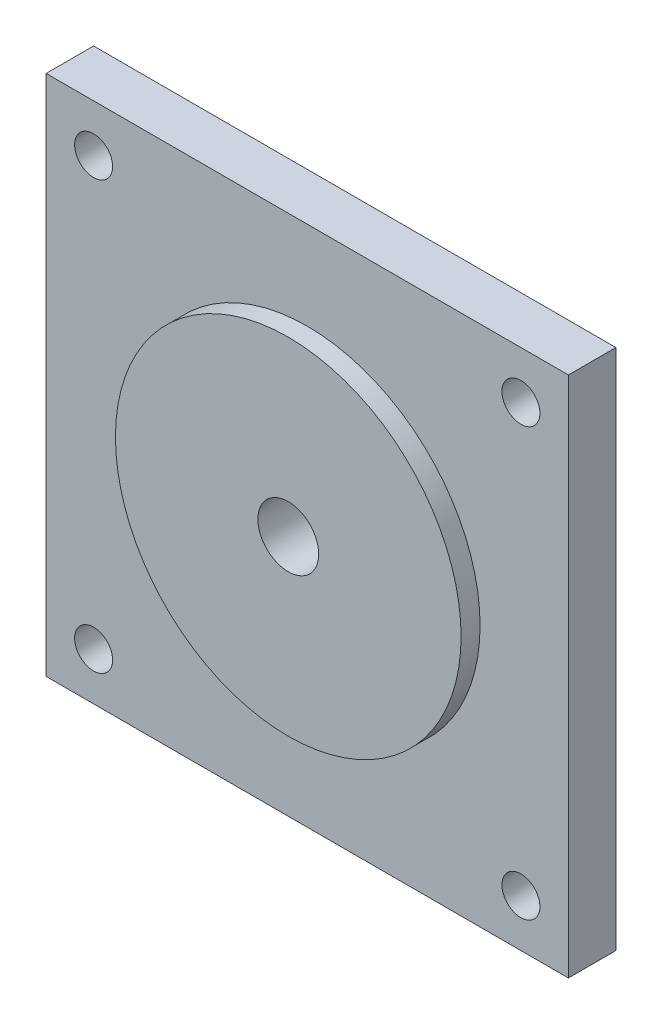
ISO-10303-21;
HEADER;
FILE_DESCRIPTION(('STEP AP214'),'2;1');
FILE_NAME('part.step','',(''),(''),'','','');
FILE_SCHEMA(('AUTOMOTIVE_DESIGN { 1 0 10303 214 1 1 1 1 }'));
ENDSEC;
DATA;
#1=APPLICATION_CONTEXT('core data for automotive mechanical design processes');
#2=APPLICATION_PROTOCOL_DEFINITION('international standard','automotive_design',2000,#1);
#3=PRODUCT_CONTEXT('',#1,'mechanical');
#4=PRODUCT('Part','Part','',(#3));
#5=PRODUCT_RELATED_PRODUCT_CATEGORY('part','',(#4));
#6=PRODUCT_DEFINITION_FORMATION('','',#4);
#7=PRODUCT_DEFINITION_CONTEXT('part definition',#1,'design');
#8=PRODUCT_DEFINITION('design','',#6,#7);
#9=PRODUCT_DEFINITION_SHAPE('','',#8);
#10=(LENGTH_UNIT() NAMED_UNIT(*) SI_UNIT(.MILLI.,.METRE.));
#11=(NAMED_UNIT(*) PLANE_ANGLE_UNIT() SI_UNIT($,.RADIAN.));
#12=(NAMED_UNIT(*) SI_UNIT($,.STERADIAN.) SOLID_ANGLE_UNIT());
#13=UNCERTAINTY_MEASURE_WITH_UNIT(LENGTH_MEASURE(1.E-05),#10,'distance_accuracy_value','');
#14=(GEOMETRIC_REPRESENTATION_CONTEXT(3) GLOBAL_UNCERTAINTY_ASSIGNED_CONTEXT((#13)) GLOBAL_UNIT_ASSIGNED_CONTEXT((#10,
#11,#12)) REPRESENTATION_CONTEXT('',''));
#15=CARTESIAN_POINT('',(0.,0.,0.));
#16=DIRECTION('',(0.,0.,1.));
#17=DIRECTION('',(1.,0.,0.));
#18=AXIS2_PLACEMENT_3D('',#15,#16,#17);
#19=CARTESIAN_POINT('',(0.,0.,5.));
#20=DIRECTION('',(0.,0.,1.));
#21=DIRECTION('',(1.,0.,0.));
#22=AXIS2_PLACEMENT_3D('',#19,#20,#21);
#23=PLANE('',#22);
#24=CARTESIAN_POINT('',(22.5,-22.5,5.));
#25=DIRECTION('',(0.,0.,1.));
#26=DIRECTION('',(1.,0.,0.));
#27=AXIS2_PLACEMENT_3D('',#24,#25,#26);
#28=CIRCLE('',#27,2.00000000000001);
#29=CARTESIAN_POINT('',(24.5,-22.5,5.));
#30=VERTEX_POINT('',#29);
#31=EDGE_CURVE('E129',#30,#30,#28,.T.);
#32=ORIENTED_EDGE('',*,*,#31,.F.);
#33=EDGE_LOOP('',(#32));
#34=FACE_BOUND('',#33,.T.);
#35=CARTESIAN_POINT('',(22.5,22.5,5.));
#36=DIRECTION('',(0.,0.,1.));
#37=DIRECTION('',(1.,0.,0.));
#38=AXIS2_PLACEMENT_3D('',#35,#36,#37);
#39=CIRCLE('',#38,2.00000000000001);
#40=CARTESIAN_POINT('',(24.5,22.5,5.));
#41=VERTEX_POINT('',#40);
#42=EDGE_CURVE('E117',#41,#41,#39,.T.);
#43=ORIENTED_EDGE('',*,*,#42,.F.);
#44=EDGE_LOOP('',(#43));
#45=FACE_BOUND('',#44,.T.);
#46=DIRECTION('',(0.,-1.,0.));
#47=VECTOR('',#46,1.);
#48=CARTESIAN_POINT('',(-27.5,27.5,5.));
#49=LINE('',#48,#47);
#50=CARTESIAN_POINT('',(-27.5,27.5,5.));
#51=VERTEX_POINT('',#50);
#52=CARTESIAN_POINT('',(-27.5,-27.5,5.));
#53=VERTEX_POINT('',#52);
#54=EDGE_CURVE('E84',#51,#53,#49,.T.);
#55=ORIENTED_EDGE('',*,*,#54,.T.);
#56=DIRECTION('',(1.,0.,0.));
#57=VECTOR('',#56,1.);
#58=CARTESIAN_POINT('',(-27.5,-27.5,5.));
#59=LINE('',#58,#57);
#60=CARTESIAN_POINT('',(27.5,-27.5,5.));
#61=VERTEX_POINT('',#60);
#62=EDGE_CURVE('E79',#53,#61,#59,.T.);
#63=ORIENTED_EDGE('',*,*,#62,.T.);
#64=DIRECTION('',(0.,1.,0.));
#65=VECTOR('',#64,1.);
#66=CARTESIAN_POINT('',(27.5,27.5,5.));
#67=LINE('',#66,#65);
#68=CARTESIAN_POINT('',(27.5,27.5,5.));
#69=VERTEX_POINT('',#68);
#70=EDGE_CURVE('E82',#61,#69,#67,.T.);
#71=ORIENTED_EDGE('',*,*,#70,.T.);
#72=DIRECTION('',(-1.,0.,0.));
#73=VECTOR('',#72,1.);
#74=CARTESIAN_POINT('',(-27.5,27.5,5.));
#75=LINE('',#74,#73);
#76=EDGE_CURVE('E49',#69,#51,#75,.T.);
#77=ORIENTED_EDGE('',*,*,#76,.T.);
#78=EDGE_LOOP('',(#55,#63,#71,#77));
#79=FACE_BOUND('',#78,.T.);
#80=CARTESIAN_POINT('',(-22.5,22.5,5.));
#81=DIRECTION('',(0.,0.,1.));
#82=DIRECTION('',(1.,0.,0.));
#83=AXIS2_PLACEMENT_3D('',#80,#81,#82);
#84=CIRCLE('',#83,2.00000000000001);
#85=CARTESIAN_POINT('',(-20.5,22.5,5.));
#86=VERTEX_POINT('',#85);
#87=EDGE_CURVE('E113',#86,#86,#84,.T.);
#88=ORIENTED_EDGE('',*,*,#87,.F.);
#89=EDGE_LOOP('',(#88));
#90=FACE_BOUND('',#89,.T.);
#91=CARTESIAN_POINT('',(-22.5,-22.5,5.));
#92=DIRECTION('',(0.,0.,1.));
#93=DIRECTION('',(1.,0.,0.));
#94=AXIS2_PLACEMENT_3D('',#91,#92,#93);
#95=CIRCLE('',#94,2.);
#96=CARTESIAN_POINT('',(-20.5,-22.5,5.));
#97=VERTEX_POINT('',#96);
#98=EDGE_CURVE('E123',#97,#97,#95,.T.);
#99=ORIENTED_EDGE('',*,*,#98,.F.);
#100=EDGE_LOOP('',(#99));
#101=FACE_BOUND('',#100,.T.);
#102=CARTESIAN_POINT('',(0.,0.,5.));
#103=DIRECTION('',(0.,0.,1.));
#104=DIRECTION('',(1.,0.,0.));
#105=AXIS2_PLACEMENT_3D('',#102,#103,#104);
#106=CIRCLE('',#105,18.2);
#107=CARTESIAN_POINT('',(18.2,0.,5.));
#108=VERTEX_POINT('',#107);
#109=EDGE_CURVE('E138',#108,#108,#106,.T.);
#110=ORIENTED_EDGE('',*,*,#109,.F.);
#111=EDGE_LOOP('',(#110));
#112=FACE_BOUND('',#111,.T.);
#113=ADVANCED_FACE('F32',(#34,#45,#79,#90,#101,#112),#23,.T.);
#114=CARTESIAN_POINT('',(0.,0.,0.));
#115=DIRECTION('',(0.,0.,1.));
#116=DIRECTION('',(1.,0.,0.));
#117=AXIS2_PLACEMENT_3D('',#114,#115,#116);
#118=PLANE('',#117);
#119=DIRECTION('',(0.,-1.,0.));
#120=VECTOR('',#119,1.);
#121=CARTESIAN_POINT('',(-27.5,27.5,0.));
#122=LINE('',#121,#120);
#123=CARTESIAN_POINT('',(-27.5,27.5,0.));
#124=VERTEX_POINT('',#123);
#125=CARTESIAN_POINT('',(-27.5,-27.5,0.));
#126=VERTEX_POINT('',#125);
#127=EDGE_CURVE('E96',#124,#126,#122,.T.);
#128=ORIENTED_EDGE('',*,*,#127,.F.);
#129=DIRECTION('',(-1.,0.,0.));
#130=VECTOR('',#129,1.);
#131=CARTESIAN_POINT('',(-27.5,27.5,0.));
#132=LINE('',#131,#130);
#133=CARTESIAN_POINT('',(27.5,27.5,0.));
#134=VERTEX_POINT('',#133);
#135=EDGE_CURVE('E72',#134,#124,#132,.T.);
#136=ORIENTED_EDGE('',*,*,#135,.F.);
#137=DIRECTION('',(0.,1.,0.));
#138=VECTOR('',#137,1.);
#139=CARTESIAN_POINT('',(27.5,27.5,0.));
#140=LINE('',#139,#138);
#141=CARTESIAN_POINT('',(27.5,-27.5,0.));
#142=VERTEX_POINT('',#141);
#143=EDGE_CURVE('E66',#142,#134,#140,.T.);
#144=ORIENTED_EDGE('',*,*,#143,.F.);
#145=DIRECTION('',(1.,0.,0.));
#146=VECTOR('',#145,1.);
#147=CARTESIAN_POINT('',(-27.5,-27.5,0.));
#148=LINE('',#147,#146);
#149=EDGE_CURVE('E88',#126,#142,#148,.T.);
#150=ORIENTED_EDGE('',*,*,#149,.F.);
#151=EDGE_LOOP('',(#128,#136,#144,#150));
#152=FACE_BOUND('',#151,.T.);
#153=CARTESIAN_POINT('',(0.,0.,0.));
#154=DIRECTION('',(0.,0.,1.));
#155=DIRECTION('',(1.,0.,0.));
#156=AXIS2_PLACEMENT_3D('',#153,#154,#155);
#157=CIRCLE('',#156,3.2);
#158=CARTESIAN_POINT('',(3.2,0.,0.));
#159=VERTEX_POINT('',#158);
#160=EDGE_CURVE('E99',#159,#159,#157,.T.);
#161=ORIENTED_EDGE('',*,*,#160,.T.);
#162=EDGE_LOOP('',(#161));
#163=FACE_BOUND('',#162,.T.);
#164=CARTESIAN_POINT('',(-22.5,22.5,0.));
#165=DIRECTION('',(0.,0.,1.));
#166=DIRECTION('',(1.,0.,0.));
#167=AXIS2_PLACEMENT_3D('',#164,#165,#166);
#168=CIRCLE('',#167,2.00000000000001);
#169=CARTESIAN_POINT('',(-20.5,22.5,0.));
#170=VERTEX_POINT('',#169);
#171=EDGE_CURVE('E114',#170,#170,#168,.T.);
#172=ORIENTED_EDGE('',*,*,#171,.T.);
#173=EDGE_LOOP('',(#172));
#174=FACE_BOUND('',#173,.T.);
#175=CARTESIAN_POINT('',(22.5,22.5,0.));
#176=DIRECTION('',(0.,0.,1.));
#177=DIRECTION('',(1.,0.,0.));
#178=AXIS2_PLACEMENT_3D('',#175,#176,#177);
#179=CIRCLE('',#178,2.00000000000001);
#180=CARTESIAN_POINT('',(24.5,22.5,0.));
#181=VERTEX_POINT('',#180);
#182=EDGE_CURVE('E120',#181,#181,#179,.T.);
#183=ORIENTED_EDGE('',*,*,#182,.T.);
#184=EDGE_LOOP('',(#183));
#185=FACE_BOUND('',#184,.T.);
#186=CARTESIAN_POINT('',(-22.5,-22.5,0.));
#187=DIRECTION('',(0.,0.,1.));
#188=DIRECTION('',(1.,0.,0.));
#189=AXIS2_PLACEMENT_3D('',#186,#187,#188);
#190=CIRCLE('',#189,2.);
#191=CARTESIAN_POINT('',(-20.5,-22.5,0.));
#192=VERTEX_POINT('',#191);
#193=EDGE_CURVE('E126',#192,#192,#190,.T.);
#194=ORIENTED_EDGE('',*,*,#193,.T.);
#195=EDGE_LOOP('',(#194));
#196=FACE_BOUND('',#195,.T.);
#197=CARTESIAN_POINT('',(22.5,-22.5,0.));
#198=DIRECTION('',(0.,0.,1.));
#199=DIRECTION('',(1.,0.,0.));
#200=AXIS2_PLACEMENT_3D('',#197,#198,#199);
#201=CIRCLE('',#200,2.00000000000001);
#202=CARTESIAN_POINT('',(24.5,-22.5,0.));
#203=VERTEX_POINT('',#202);
#204=EDGE_CURVE('E132',#203,#203,#201,.T.);
#205=ORIENTED_EDGE('',*,*,#204,.T.);
#206=EDGE_LOOP('',(#205));
#207=FACE_BOUND('',#206,.T.);
#208=ADVANCED_FACE('F107',(#152,#163,#174,#185,#196,#207),#118,.F.);
#209=CARTESIAN_POINT('',(-27.5,27.5,5.));
#210=DIRECTION('',(1.,0.,0.));
#211=DIRECTION('',(0.,1.,0.));
#212=AXIS2_PLACEMENT_3D('',#209,#210,#211);
#213=PLANE('',#212);
#214=ORIENTED_EDGE('',*,*,#127,.T.);
#215=DIRECTION('',(0.,0.,-1.));
#216=VECTOR('',#215,1.);
#217=CARTESIAN_POINT('',(-27.5,-27.5,5.));
#218=LINE('',#217,#216);
#219=EDGE_CURVE('E11',#53,#126,#218,.T.);
#220=ORIENTED_EDGE('',*,*,#219,.F.);
#221=ORIENTED_EDGE('',*,*,#54,.F.);
#222=DIRECTION('',(0.,0.,-1.));
#223=VECTOR('',#222,1.);
#224=CARTESIAN_POINT('',(-27.5,27.5,5.));
#225=LINE('',#224,#223);
#226=EDGE_CURVE('E92',#51,#124,#225,.T.);
#227=ORIENTED_EDGE('',*,*,#226,.T.);
#228=EDGE_LOOP('',(#214,#220,#221,#227));
#229=FACE_BOUND('',#228,.T.);
#230=ADVANCED_FACE('F34',(#229),#213,.F.);
#231=CARTESIAN_POINT('',(-27.5,-27.5,5.));
#232=DIRECTION('',(0.,1.,0.));
#233=DIRECTION('',(0.,0.,1.));
#234=AXIS2_PLACEMENT_3D('',#231,#232,#233);
#235=PLANE('',#234);
#236=ORIENTED_EDGE('',*,*,#149,.T.);
#237=DIRECTION('',(0.,0.,-1.));
#238=VECTOR('',#237,1.);
#239=CARTESIAN_POINT('',(27.5,-27.5,5.));
#240=LINE('',#239,#238);
#241=EDGE_CURVE('E41',#61,#142,#240,.T.);
#242=ORIENTED_EDGE('',*,*,#241,.F.);
#243=ORIENTED_EDGE('',*,*,#62,.F.);
#244=ORIENTED_EDGE('',*,*,#219,.T.);
#245=EDGE_LOOP('',(#236,#242,#243,#244));
#246=FACE_BOUND('',#245,.T.);
#247=ADVANCED_FACE('F87',(#246),#235,.F.);
#248=CARTESIAN_POINT('',(27.5,27.5,5.));
#249=DIRECTION('',(-1.,0.,0.));
#250=DIRECTION('',(0.,-1.,0.));
#251=AXIS2_PLACEMENT_3D('',#248,#249,#250);
#252=PLANE('',#251);
#253=ORIENTED_EDGE('',*,*,#143,.T.);
#254=DIRECTION('',(0.,0.,-1.));
#255=VECTOR('',#254,1.);
#256=CARTESIAN_POINT('',(27.5,27.5,5.));
#257=LINE('',#256,#255);
#258=EDGE_CURVE('E89',#69,#134,#257,.T.);
#259=ORIENTED_EDGE('',*,*,#258,.F.);
#260=ORIENTED_EDGE('',*,*,#70,.F.);
#261=ORIENTED_EDGE('',*,*,#241,.T.);
#262=EDGE_LOOP('',(#253,#259,#260,#261));
#263=FACE_BOUND('',#262,.T.);
#264=ADVANCED_FACE('F90',(#263),#252,.F.);
#265=CARTESIAN_POINT('',(-27.5,27.5,5.));
#266=DIRECTION('',(0.,-1.,0.));
#267=DIRECTION('',(0.,0.,-1.));
#268=AXIS2_PLACEMENT_3D('',#265,#266,#267);
#269=PLANE('',#268);
#270=ORIENTED_EDGE('',*,*,#135,.T.);
#271=ORIENTED_EDGE('',*,*,#226,.F.);
#272=ORIENTED_EDGE('',*,*,#76,.F.);
#273=ORIENTED_EDGE('',*,*,#258,.T.);
#274=EDGE_LOOP('',(#270,#271,#272,#273));
#275=FACE_BOUND('',#274,.T.);
#276=ADVANCED_FACE('F104',(#275),#269,.F.);
#277=CARTESIAN_POINT('',(0.,0.,5.));
#278=DIRECTION('',(0.,0.,-1.));
#279=DIRECTION('',(-1.,0.,0.));
#280=AXIS2_PLACEMENT_3D('',#277,#278,#279);
#281=CYLINDRICAL_SURFACE('',#280,3.2);
#282=ORIENTED_EDGE('',*,*,#160,.F.);
#283=EDGE_LOOP('',(#282));
#284=FACE_BOUND('',#283,.T.);
#285=CARTESIAN_POINT('',(0.,0.,7.));
#286=DIRECTION('',(0.,0.,1.));
#287=DIRECTION('',(1.,0.,0.));
#288=AXIS2_PLACEMENT_3D('',#285,#286,#287);
#289=CIRCLE('',#288,3.2);
#290=CARTESIAN_POINT('',(3.2,0.,7.));
#291=VERTEX_POINT('',#290);
#292=EDGE_CURVE('E141',#291,#291,#289,.T.);
#293=ORIENTED_EDGE('',*,*,#292,.T.);
#294=EDGE_LOOP('',(#293));
#295=FACE_BOUND('',#294,.T.);
#296=ADVANCED_FACE('F147',(#284,#295),#281,.F.);
#297=CARTESIAN_POINT('',(-22.5,22.5,5.));
#298=DIRECTION('',(0.,0.,-1.));
#299=DIRECTION('',(-1.,0.,0.));
#300=AXIS2_PLACEMENT_3D('',#297,#298,#299);
#301=CYLINDRICAL_SURFACE('',#300,2.00000000000001);
#302=ORIENTED_EDGE('',*,*,#87,.T.);
#303=EDGE_LOOP('',(#302));
#304=FACE_BOUND('',#303,.T.);
#305=ORIENTED_EDGE('',*,*,#171,.F.);
#306=EDGE_LOOP('',(#305));
#307=FACE_BOUND('',#306,.T.);
#308=ADVANCED_FACE('F216',(#304,#307),#301,.F.);
#309=CARTESIAN_POINT('',(22.5,22.5,5.));
#310=DIRECTION('',(0.,0.,-1.));
#311=DIRECTION('',(-1.,0.,0.));
#312=AXIS2_PLACEMENT_3D('',#309,#310,#311);
#313=CYLINDRICAL_SURFACE('',#312,2.00000000000001);
#314=ORIENTED_EDGE('',*,*,#42,.T.);
#315=EDGE_LOOP('',(#314));
#316=FACE_BOUND('',#315,.T.);
#317=ORIENTED_EDGE('',*,*,#182,.F.);
#318=EDGE_LOOP('',(#317));
#319=FACE_BOUND('',#318,.T.);
#320=ADVANCED_FACE('F227',(#316,#319),#313,.F.);
#321=CARTESIAN_POINT('',(-22.5,-22.5,5.));
#322=DIRECTION('',(0.,0.,-1.));
#323=DIRECTION('',(-1.,0.,0.));
#324=AXIS2_PLACEMENT_3D('',#321,#322,#323);
#325=CYLINDRICAL_SURFACE('',#324,2.);
#326=ORIENTED_EDGE('',*,*,#98,.T.);
#327=EDGE_LOOP('',(#326));
#328=FACE_BOUND('',#327,.T.);
#329=ORIENTED_EDGE('',*,*,#193,.F.);
#330=EDGE_LOOP('',(#329));
#331=FACE_BOUND('',#330,.T.);
#332=ADVANCED_FACE('F161',(#328,#331),#325,.F.);
#333=CARTESIAN_POINT('',(22.5,-22.5,5.));
#334=DIRECTION('',(0.,0.,-1.));
#335=DIRECTION('',(-1.,0.,0.));
#336=AXIS2_PLACEMENT_3D('',#333,#334,#335);
#337=CYLINDRICAL_SURFACE('',#336,2.00000000000001);
#338=ORIENTED_EDGE('',*,*,#31,.T.);
#339=EDGE_LOOP('',(#338));
#340=FACE_BOUND('',#339,.T.);
#341=ORIENTED_EDGE('',*,*,#204,.F.);
#342=EDGE_LOOP('',(#341));
#343=FACE_BOUND('',#342,.T.);
#344=ADVANCED_FACE('F152',(#340,#343),#337,.F.);
#345=CARTESIAN_POINT('',(0.,0.,7.));
#346=DIRECTION('',(0.,0.,1.));
#347=DIRECTION('',(1.,0.,0.));
#348=AXIS2_PLACEMENT_3D('',#345,#346,#347);
#349=PLANE('',#348);
#350=CARTESIAN_POINT('',(0.,0.,7.));
#351=DIRECTION('',(0.,0.,1.));
#352=DIRECTION('',(1.,0.,0.));
#353=AXIS2_PLACEMENT_3D('',#350,#351,#352);
#354=CIRCLE('',#353,18.2);
#355=CARTESIAN_POINT('',(18.2,0.,7.));
#356=VERTEX_POINT('',#355);
#357=EDGE_CURVE('E135',#356,#356,#354,.T.);
#358=ORIENTED_EDGE('',*,*,#357,.T.);
#359=EDGE_LOOP('',(#358));
#360=FACE_BOUND('',#359,.T.);
#361=ORIENTED_EDGE('',*,*,#292,.F.);
#362=EDGE_LOOP('',(#361));
#363=FACE_BOUND('',#362,.T.);
#364=ADVANCED_FACE('F149',(#360,#363),#349,.T.);
#365=CARTESIAN_POINT('',(0.,0.,7.));
#366=DIRECTION('',(0.,0.,-1.));
#367=DIRECTION('',(-1.,0.,0.));
#368=AXIS2_PLACEMENT_3D('',#365,#366,#367);
#369=CYLINDRICAL_SURFACE('',#368,18.2);
#370=ORIENTED_EDGE('',*,*,#357,.F.);
#371=EDGE_LOOP('',(#370));
#372=FACE_BOUND('',#371,.T.);
#373=ORIENTED_EDGE('',*,*,#109,.T.);
#374=EDGE_LOOP('',(#373));
#375=FACE_BOUND('',#374,.T.);
#376=ADVANCED_FACE('F151',(#372,#375),#369,.T.);
#377=CLOSED_SHELL('',(#113,#208,#230,#247,#264,#276,#296,#308,#320,#332,#344,#364,#376));
#378=MANIFOLD_SOLID_BREP('B2',#377);
#379=ADVANCED_BREP_SHAPE_REPRESENTATION('',(#18,#378),#14);
#380=SHAPE_DEFINITION_REPRESENTATION(#9,#379);
ENDSEC;
END-ISO-10303-21;
